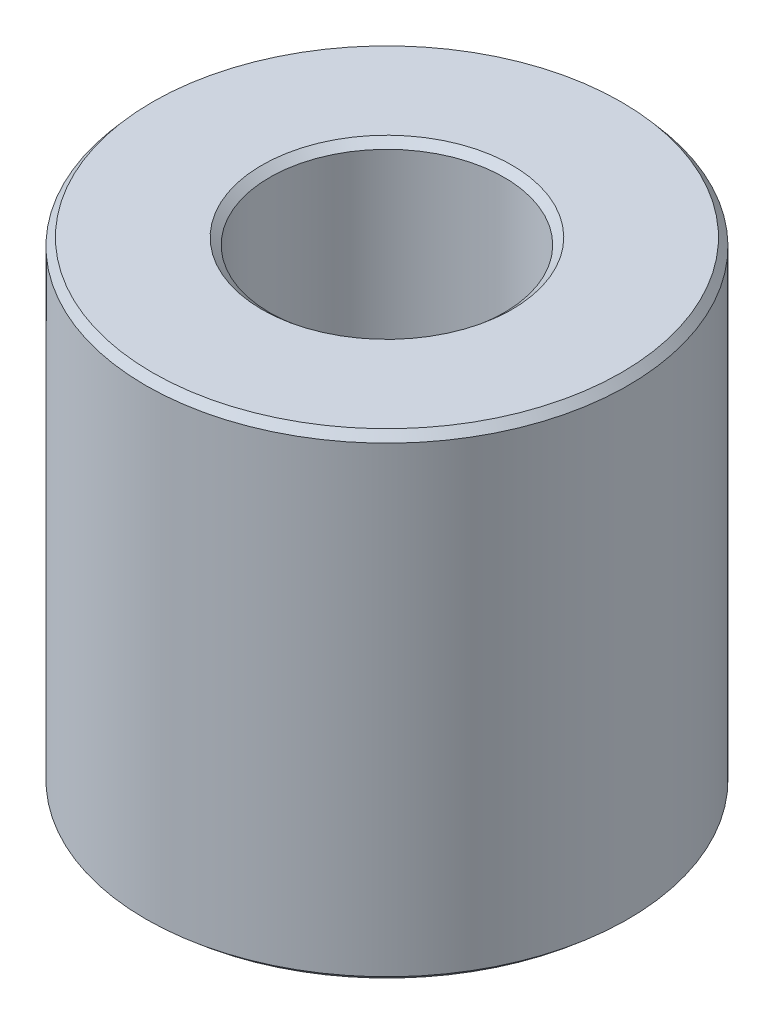
ISO-10303-21;
HEADER;
FILE_DESCRIPTION(('STEP AP214'),'2;1');
FILE_NAME('part.step','',(''),(''),'','','');
FILE_SCHEMA(('AUTOMOTIVE_DESIGN { 1 0 10303 214 1 1 1 1 }'));
ENDSEC;
DATA;
#1=APPLICATION_CONTEXT('core data for automotive mechanical design processes');
#2=APPLICATION_PROTOCOL_DEFINITION('international standard','automotive_design',2000,#1);
#3=PRODUCT_CONTEXT('',#1,'mechanical');
#4=PRODUCT('Part','Part','',(#3));
#5=PRODUCT_RELATED_PRODUCT_CATEGORY('part','',(#4));
#6=PRODUCT_DEFINITION_FORMATION('','',#4);
#7=PRODUCT_DEFINITION_CONTEXT('part definition',#1,'design');
#8=PRODUCT_DEFINITION('design','',#6,#7);
#9=PRODUCT_DEFINITION_SHAPE('','',#8);
#10=(LENGTH_UNIT() NAMED_UNIT(*) SI_UNIT(.MILLI.,.METRE.));
#11=(NAMED_UNIT(*) PLANE_ANGLE_UNIT() SI_UNIT($,.RADIAN.));
#12=(NAMED_UNIT(*) SI_UNIT($,.STERADIAN.) SOLID_ANGLE_UNIT());
#13=UNCERTAINTY_MEASURE_WITH_UNIT(LENGTH_MEASURE(1.E-05),#10,'distance_accuracy_value','');
#14=(GEOMETRIC_REPRESENTATION_CONTEXT(3) GLOBAL_UNCERTAINTY_ASSIGNED_CONTEXT((#13)) GLOBAL_UNIT_ASSIGNED_CONTEXT((#10,
#11,#12)) REPRESENTATION_CONTEXT('',''));
#15=CARTESIAN_POINT('',(0.,0.,0.));
#16=DIRECTION('',(0.,0.,1.));
#17=DIRECTION('',(1.,0.,0.));
#18=AXIS2_PLACEMENT_3D('',#15,#16,#17);
#19=CARTESIAN_POINT('',(0.,19.7639206189434,0.));
#20=DIRECTION('',(0.,-1.,0.));
#21=DIRECTION('',(0.,0.,-1.));
#22=AXIS2_PLACEMENT_3D('',#19,#20,#21);
#23=CYLINDRICAL_SURFACE('',#22,10.);
#24=CARTESIAN_POINT('',(0.,0.277493904327422,0.));
#25=DIRECTION('',(0.,1.,0.));
#26=DIRECTION('',(0.,0.,1.));
#27=AXIS2_PLACEMENT_3D('',#24,#25,#26);
#28=CIRCLE('',#27,10.);
#29=CARTESIAN_POINT('',(0.,0.277493904327422,10.));
#30=VERTEX_POINT('',#29);
#31=EDGE_CURVE('E10',#30,#30,#28,.T.);
#32=ORIENTED_EDGE('',*,*,#31,.T.);
#33=EDGE_LOOP('',(#32));
#34=FACE_BOUND('',#33,.T.);
#35=CARTESIAN_POINT('',(0.,19.4402822120215,0.));
#36=DIRECTION('',(0.,1.,0.));
#37=DIRECTION('',(0.,0.,1.));
#38=AXIS2_PLACEMENT_3D('',#35,#36,#37);
#39=CIRCLE('',#38,10.);
#40=CARTESIAN_POINT('',(0.,19.4402822120215,10.));
#41=VERTEX_POINT('',#40);
#42=EDGE_CURVE('E50',#41,#41,#39,.F.);
#43=ORIENTED_EDGE('',*,*,#42,.T.);
#44=EDGE_LOOP('',(#43));
#45=FACE_BOUND('',#44,.T.);
#46=ADVANCED_FACE('F39',(#34,#45),#23,.T.);
#47=CARTESIAN_POINT('',(0.,19.7639206189434,0.));
#48=DIRECTION('',(0.,1.,0.));
#49=DIRECTION('',(0.,0.,1.));
#50=AXIS2_PLACEMENT_3D('',#47,#48,#49);
#51=PLANE('',#50);
#52=CARTESIAN_POINT('',(0.,19.7639206189434,0.));
#53=DIRECTION('',(0.,1.,0.));
#54=DIRECTION('',(0.,0.,1.));
#55=AXIS2_PLACEMENT_3D('',#52,#53,#54);
#56=CIRCLE('',#55,5.18556675927675);
#57=CARTESIAN_POINT('',(0.,19.7639206189434,5.18556675927675));
#58=VERTEX_POINT('',#57);
#59=EDGE_CURVE('E58',#58,#58,#56,.F.);
#60=ORIENTED_EDGE('',*,*,#59,.T.);
#61=EDGE_LOOP('',(#60));
#62=FACE_BOUND('',#61,.T.);
#63=CARTESIAN_POINT('',(0.,19.7639206189434,0.));
#64=DIRECTION('',(0.,1.,0.));
#65=DIRECTION('',(0.,0.,1.));
#66=AXIS2_PLACEMENT_3D('',#63,#64,#65);
#67=CIRCLE('',#66,9.72250609567257);
#68=CARTESIAN_POINT('',(0.,19.7639206189434,9.72250609567257));
#69=VERTEX_POINT('',#68);
#70=EDGE_CURVE('E61',#69,#69,#67,.T.);
#71=ORIENTED_EDGE('',*,*,#70,.T.);
#72=EDGE_LOOP('',(#71));
#73=FACE_BOUND('',#72,.T.);
#74=ADVANCED_FACE('F88',(#62,#73),#51,.T.);
#75=CARTESIAN_POINT('',(0.,0.,0.));
#76=DIRECTION('',(0.,1.,0.));
#77=DIRECTION('',(0.,0.,1.));
#78=AXIS2_PLACEMENT_3D('',#75,#76,#77);
#79=PLANE('',#78);
#80=CARTESIAN_POINT('',(0.,0.,0.));
#81=DIRECTION('',(0.,1.,0.));
#82=DIRECTION('',(0.,0.,1.));
#83=AXIS2_PLACEMENT_3D('',#80,#81,#82);
#84=CIRCLE('',#83,5.13942225668224);
#85=CARTESIAN_POINT('',(0.,0.,5.13942225668224));
#86=VERTEX_POINT('',#85);
#87=EDGE_CURVE('E51',#86,#86,#84,.T.);
#88=ORIENTED_EDGE('',*,*,#87,.T.);
#89=EDGE_LOOP('',(#88));
#90=FACE_BOUND('',#89,.T.);
#91=CARTESIAN_POINT('',(0.,0.,0.));
#92=DIRECTION('',(0.,1.,0.));
#93=DIRECTION('',(0.,0.,1.));
#94=AXIS2_PLACEMENT_3D('',#91,#92,#93);
#95=CIRCLE('',#94,9.67636159307808);
#96=CARTESIAN_POINT('',(0.,0.,9.67636159307808));
#97=VERTEX_POINT('',#96);
#98=EDGE_CURVE('E54',#97,#97,#95,.F.);
#99=ORIENTED_EDGE('',*,*,#98,.T.);
#100=EDGE_LOOP('',(#99));
#101=FACE_BOUND('',#100,.T.);
#102=ADVANCED_FACE('F83',(#90,#101),#79,.F.);
#103=CARTESIAN_POINT('',(0.,19.7639206189434,0.));
#104=DIRECTION('',(0.,-1.,0.));
#105=DIRECTION('',(0.,0.,-1.));
#106=AXIS2_PLACEMENT_3D('',#103,#104,#105);
#107=CYLINDRICAL_SURFACE('',#106,4.86192835235482);
#108=CARTESIAN_POINT('',(0.,19.486426714616,0.));
#109=DIRECTION('',(0.,1.,0.));
#110=DIRECTION('',(0.,0.,1.));
#111=AXIS2_PLACEMENT_3D('',#108,#109,#110);
#112=CIRCLE('',#111,4.86192835235482);
#113=CARTESIAN_POINT('',(0.,19.486426714616,4.86192835235482));
#114=VERTEX_POINT('',#113);
#115=EDGE_CURVE('E67',#114,#114,#112,.T.);
#116=ORIENTED_EDGE('',*,*,#115,.T.);
#117=EDGE_LOOP('',(#116));
#118=FACE_BOUND('',#117,.T.);
#119=CARTESIAN_POINT('',(0.,0.323638406921928,0.));
#120=DIRECTION('',(0.,1.,0.));
#121=DIRECTION('',(0.,0.,1.));
#122=AXIS2_PLACEMENT_3D('',#119,#120,#121);
#123=CIRCLE('',#122,4.86192835235482);
#124=CARTESIAN_POINT('',(0.,0.323638406921928,4.86192835235482));
#125=VERTEX_POINT('',#124);
#126=EDGE_CURVE('E69',#125,#125,#123,.F.);
#127=ORIENTED_EDGE('',*,*,#126,.T.);
#128=EDGE_LOOP('',(#127));
#129=FACE_BOUND('',#128,.T.);
#130=ADVANCED_FACE('F71',(#118,#129),#107,.F.);
#131=CARTESIAN_POINT('',(0.,19.486426714616,0.));
#132=DIRECTION('',(0.,1.,0.));
#133=DIRECTION('',(0.,0.,1.));
#134=AXIS2_PLACEMENT_3D('',#131,#132,#133);
#135=CONICAL_SURFACE('',#134,4.86192835235482,0.862010558532609);
#136=ORIENTED_EDGE('',*,*,#59,.F.);
#137=EDGE_LOOP('',(#136));
#138=FACE_BOUND('',#137,.T.);
#139=ORIENTED_EDGE('',*,*,#115,.F.);
#140=EDGE_LOOP('',(#139));
#141=FACE_BOUND('',#140,.T.);
#142=ADVANCED_FACE('F77',(#138,#141),#135,.F.);
#143=CARTESIAN_POINT('',(0.,0.,0.));
#144=DIRECTION('',(0.,-1.,0.));
#145=DIRECTION('',(0.,0.,-1.));
#146=AXIS2_PLACEMENT_3D('',#143,#144,#145);
#147=CONICAL_SURFACE('',#146,5.13942225668224,0.708785768262277);
#148=ORIENTED_EDGE('',*,*,#126,.F.);
#149=EDGE_LOOP('',(#148));
#150=FACE_BOUND('',#149,.T.);
#151=ORIENTED_EDGE('',*,*,#87,.F.);
#152=EDGE_LOOP('',(#151));
#153=FACE_BOUND('',#152,.T.);
#154=ADVANCED_FACE('F73',(#150,#153),#147,.F.);
#155=CARTESIAN_POINT('',(0.,0.277493904327422,0.));
#156=DIRECTION('',(0.,1.,0.));
#157=DIRECTION('',(0.,0.,1.));
#158=AXIS2_PLACEMENT_3D('',#155,#156,#157);
#159=CONICAL_SURFACE('',#158,10.,0.862010558532622);
#160=ORIENTED_EDGE('',*,*,#98,.F.);
#161=EDGE_LOOP('',(#160));
#162=FACE_BOUND('',#161,.T.);
#163=ORIENTED_EDGE('',*,*,#31,.F.);
#164=EDGE_LOOP('',(#163));
#165=FACE_BOUND('',#164,.T.);
#166=ADVANCED_FACE('F76',(#162,#165),#159,.T.);
#167=CARTESIAN_POINT('',(0.,19.7639206189434,0.));
#168=DIRECTION('',(0.,-1.,0.));
#169=DIRECTION('',(0.,0.,-1.));
#170=AXIS2_PLACEMENT_3D('',#167,#168,#169);
#171=CONICAL_SURFACE('',#170,9.72250609567257,0.708785768262276);
#172=ORIENTED_EDGE('',*,*,#42,.F.);
#173=EDGE_LOOP('',(#172));
#174=FACE_BOUND('',#173,.T.);
#175=ORIENTED_EDGE('',*,*,#70,.F.);
#176=EDGE_LOOP('',(#175));
#177=FACE_BOUND('',#176,.T.);
#178=ADVANCED_FACE('F45',(#174,#177),#171,.T.);
#179=CLOSED_SHELL('',(#46,#74,#102,#130,#142,#154,#166,#178));
#180=MANIFOLD_SOLID_BREP('B2',#179);
#181=ADVANCED_BREP_SHAPE_REPRESENTATION('',(#18,#180),#14);
#182=SHAPE_DEFINITION_REPRESENTATION(#9,#181);
ENDSEC;
END-ISO-10303-21;
